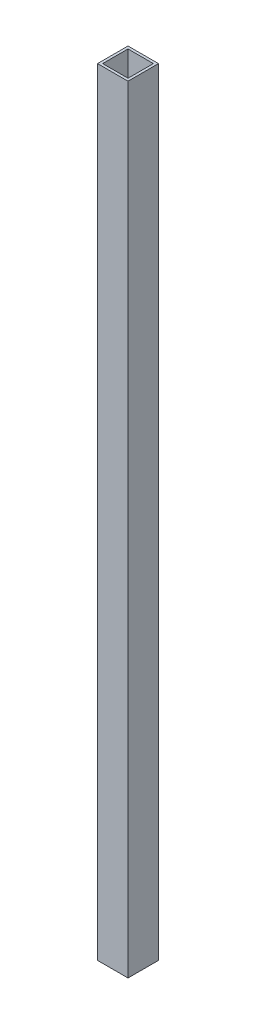
ISO-10303-21;
HEADER;
FILE_DESCRIPTION(('STEP AP214'),'2;1');
FILE_NAME('part.step','',(''),(''),'','','');
FILE_SCHEMA(('AUTOMOTIVE_DESIGN { 1 0 10303 214 1 1 1 1 }'));
ENDSEC;
DATA;
#1=APPLICATION_CONTEXT('core data for automotive mechanical design processes');
#2=APPLICATION_PROTOCOL_DEFINITION('international standard','automotive_design',2000,#1);
#3=PRODUCT_CONTEXT('',#1,'mechanical');
#4=PRODUCT('Part','Part','',(#3));
#5=PRODUCT_RELATED_PRODUCT_CATEGORY('part','',(#4));
#6=PRODUCT_DEFINITION_FORMATION('','',#4);
#7=PRODUCT_DEFINITION_CONTEXT('part definition',#1,'design');
#8=PRODUCT_DEFINITION('design','',#6,#7);
#9=PRODUCT_DEFINITION_SHAPE('','',#8);
#10=(LENGTH_UNIT() NAMED_UNIT(*) SI_UNIT(.MILLI.,.METRE.));
#11=(NAMED_UNIT(*) PLANE_ANGLE_UNIT() SI_UNIT($,.RADIAN.));
#12=(NAMED_UNIT(*) SI_UNIT($,.STERADIAN.) SOLID_ANGLE_UNIT());
#13=UNCERTAINTY_MEASURE_WITH_UNIT(LENGTH_MEASURE(1.E-05),#10,'distance_accuracy_value','');
#14=(GEOMETRIC_REPRESENTATION_CONTEXT(3) GLOBAL_UNCERTAINTY_ASSIGNED_CONTEXT((#13)) GLOBAL_UNIT_ASSIGNED_CONTEXT((#10,
#11,#12)) REPRESENTATION_CONTEXT('',''));
#15=CARTESIAN_POINT('',(0.,0.,0.));
#16=DIRECTION('',(0.,0.,1.));
#17=DIRECTION('',(1.,0.,0.));
#18=AXIS2_PLACEMENT_3D('',#15,#16,#17);
#19=CARTESIAN_POINT('',(0.,0.,-38.1));
#20=DIRECTION('',(-1.,0.,0.));
#21=DIRECTION('',(0.,-1.,0.));
#22=AXIS2_PLACEMENT_3D('',#19,#20,#21);
#23=PLANE('',#22);
#24=DIRECTION('',(0.,0.,-1.));
#25=VECTOR('',#24,1.);
#26=CARTESIAN_POINT('',(0.,1009.65,-38.1));
#27=LINE('',#26,#25);
#28=CARTESIAN_POINT('',(0.,1009.65,0.));
#29=VERTEX_POINT('',#28);
#30=CARTESIAN_POINT('',(0.,1009.65,-38.1));
#31=VERTEX_POINT('',#30);
#32=EDGE_CURVE('E111',#29,#31,#27,.T.);
#33=ORIENTED_EDGE('',*,*,#32,.F.);
#34=DIRECTION('',(0.,1.,0.));
#35=VECTOR('',#34,1.);
#36=CARTESIAN_POINT('',(0.,0.,0.));
#37=LINE('',#36,#35);
#38=CARTESIAN_POINT('',(0.,38.1,0.));
#39=VERTEX_POINT('',#38);
#40=EDGE_CURVE('E47',#39,#29,#37,.T.);
#41=ORIENTED_EDGE('',*,*,#40,.F.);
#42=DIRECTION('',(0.,0.,1.));
#43=VECTOR('',#42,1.);
#44=CARTESIAN_POINT('',(0.,38.1,-38.1));
#45=LINE('',#44,#43);
#46=CARTESIAN_POINT('',(0.,38.1,-38.1));
#47=VERTEX_POINT('',#46);
#48=EDGE_CURVE('E123',#47,#39,#45,.T.);
#49=ORIENTED_EDGE('',*,*,#48,.F.);
#50=DIRECTION('',(0.,1.,0.));
#51=VECTOR('',#50,1.);
#52=CARTESIAN_POINT('',(0.,0.,-38.1));
#53=LINE('',#52,#51);
#54=EDGE_CURVE('E130',#47,#31,#53,.T.);
#55=ORIENTED_EDGE('',*,*,#54,.T.);
#56=EDGE_LOOP('',(#33,#41,#49,#55));
#57=FACE_BOUND('',#56,.T.);
#58=ADVANCED_FACE('F33',(#57),#23,.F.);
#59=CARTESIAN_POINT('',(-38.1,0.,0.));
#60=DIRECTION('',(0.,0.,-1.));
#61=DIRECTION('',(-1.,0.,0.));
#62=AXIS2_PLACEMENT_3D('',#59,#60,#61);
#63=PLANE('',#62);
#64=DIRECTION('',(1.,0.,0.));
#65=VECTOR('',#64,1.);
#66=CARTESIAN_POINT('',(-38.0999999999998,1009.65,0.));
#67=LINE('',#66,#65);
#68=CARTESIAN_POINT('',(-38.1,1009.65,0.));
#69=VERTEX_POINT('',#68);
#70=EDGE_CURVE('E147',#69,#29,#67,.T.);
#71=ORIENTED_EDGE('',*,*,#70,.F.);
#72=DIRECTION('',(0.,1.,0.));
#73=VECTOR('',#72,1.);
#74=CARTESIAN_POINT('',(-38.1,0.,0.));
#75=LINE('',#74,#73);
#76=CARTESIAN_POINT('',(-38.1,38.1,0.));
#77=VERTEX_POINT('',#76);
#78=EDGE_CURVE('E120',#77,#69,#75,.T.);
#79=ORIENTED_EDGE('',*,*,#78,.F.);
#80=DIRECTION('',(1.,0.,0.));
#81=VECTOR('',#80,1.);
#82=CARTESIAN_POINT('',(-723.9,38.0999999999999,0.));
#83=LINE('',#82,#81);
#84=EDGE_CURVE('E158',#77,#39,#83,.T.);
#85=ORIENTED_EDGE('',*,*,#84,.T.);
#86=ORIENTED_EDGE('',*,*,#40,.T.);
#87=EDGE_LOOP('',(#71,#79,#85,#86));
#88=FACE_BOUND('',#87,.T.);
#89=ADVANCED_FACE('F173',(#88),#63,.F.);
#90=CARTESIAN_POINT('',(-38.1,0.,-38.1));
#91=DIRECTION('',(1.,0.,0.));
#92=DIRECTION('',(0.,1.,0.));
#93=AXIS2_PLACEMENT_3D('',#90,#91,#92);
#94=PLANE('',#93);
#95=DIRECTION('',(0.,0.,1.));
#96=VECTOR('',#95,1.);
#97=CARTESIAN_POINT('',(-38.1,1009.65,-38.1));
#98=LINE('',#97,#96);
#99=CARTESIAN_POINT('',(-38.1,1009.65,-38.1));
#100=VERTEX_POINT('',#99);
#101=EDGE_CURVE('E150',#100,#69,#98,.T.);
#102=ORIENTED_EDGE('',*,*,#101,.F.);
#103=DIRECTION('',(0.,1.,0.));
#104=VECTOR('',#103,1.);
#105=CARTESIAN_POINT('',(-38.1,0.,-38.1));
#106=LINE('',#105,#104);
#107=CARTESIAN_POINT('',(-38.1,38.1,-38.1));
#108=VERTEX_POINT('',#107);
#109=EDGE_CURVE('E132',#108,#100,#106,.T.);
#110=ORIENTED_EDGE('',*,*,#109,.F.);
#111=DIRECTION('',(0.,0.,-1.));
#112=VECTOR('',#111,1.);
#113=CARTESIAN_POINT('',(-38.1,38.1,-38.1));
#114=LINE('',#113,#112);
#115=EDGE_CURVE('E164',#77,#108,#114,.T.);
#116=ORIENTED_EDGE('',*,*,#115,.F.);
#117=ORIENTED_EDGE('',*,*,#78,.T.);
#118=EDGE_LOOP('',(#102,#110,#116,#117));
#119=FACE_BOUND('',#118,.T.);
#120=ADVANCED_FACE('F176',(#119),#94,.F.);
#121=CARTESIAN_POINT('',(-38.1,0.,-38.1));
#122=DIRECTION('',(0.,0.,1.));
#123=DIRECTION('',(1.,0.,0.));
#124=AXIS2_PLACEMENT_3D('',#121,#122,#123);
#125=PLANE('',#124);
#126=DIRECTION('',(-1.,0.,0.));
#127=VECTOR('',#126,1.);
#128=CARTESIAN_POINT('',(-38.0999999999998,1009.65,-38.1));
#129=LINE('',#128,#127);
#130=EDGE_CURVE('E153',#31,#100,#129,.T.);
#131=ORIENTED_EDGE('',*,*,#130,.F.);
#132=ORIENTED_EDGE('',*,*,#54,.F.);
#133=DIRECTION('',(1.,0.,0.));
#134=VECTOR('',#133,1.);
#135=CARTESIAN_POINT('',(-723.9,38.0999999999999,-38.1));
#136=LINE('',#135,#134);
#137=EDGE_CURVE('E156',#108,#47,#136,.T.);
#138=ORIENTED_EDGE('',*,*,#137,.F.);
#139=ORIENTED_EDGE('',*,*,#109,.T.);
#140=EDGE_LOOP('',(#131,#132,#138,#139));
#141=FACE_BOUND('',#140,.T.);
#142=ADVANCED_FACE('F179',(#141),#125,.F.);
#143=CARTESIAN_POINT('',(-723.9,38.0999999999999,-38.1));
#144=DIRECTION('',(0.,-1.,0.));
#145=DIRECTION('',(1.,0.,0.));
#146=AXIS2_PLACEMENT_3D('',#143,#144,#145);
#147=PLANE('',#146);
#148=DIRECTION('',(1.,0.,0.));
#149=VECTOR('',#148,1.);
#150=CARTESIAN_POINT('',(-34.925,38.1,-34.925));
#151=LINE('',#150,#149);
#152=CARTESIAN_POINT('',(-34.925,38.1,-34.925));
#153=VERTEX_POINT('',#152);
#154=CARTESIAN_POINT('',(-3.175,38.1,-34.925));
#155=VERTEX_POINT('',#154);
#156=EDGE_CURVE('E161',#153,#155,#151,.T.);
#157=ORIENTED_EDGE('',*,*,#156,.F.);
#158=DIRECTION('',(0.,0.,-1.));
#159=VECTOR('',#158,1.);
#160=CARTESIAN_POINT('',(-34.925,38.1,-34.925));
#161=LINE('',#160,#159);
#162=CARTESIAN_POINT('',(-34.925,38.1,-3.175));
#163=VERTEX_POINT('',#162);
#164=EDGE_CURVE('E140',#163,#153,#161,.T.);
#165=ORIENTED_EDGE('',*,*,#164,.F.);
#166=DIRECTION('',(-1.,0.,0.));
#167=VECTOR('',#166,1.);
#168=CARTESIAN_POINT('',(-34.925,38.1,-3.175));
#169=LINE('',#168,#167);
#170=CARTESIAN_POINT('',(-3.175,38.1,-3.175));
#171=VERTEX_POINT('',#170);
#172=EDGE_CURVE('E40',#171,#163,#169,.T.);
#173=ORIENTED_EDGE('',*,*,#172,.F.);
#174=DIRECTION('',(0.,0.,1.));
#175=VECTOR('',#174,1.);
#176=CARTESIAN_POINT('',(-3.175,38.1,-34.925));
#177=LINE('',#176,#175);
#178=EDGE_CURVE('E116',#155,#171,#177,.T.);
#179=ORIENTED_EDGE('',*,*,#178,.F.);
#180=EDGE_LOOP('',(#157,#165,#173,#179));
#181=FACE_BOUND('',#180,.T.);
#182=ORIENTED_EDGE('',*,*,#48,.T.);
#183=ORIENTED_EDGE('',*,*,#84,.F.);
#184=ORIENTED_EDGE('',*,*,#115,.T.);
#185=ORIENTED_EDGE('',*,*,#137,.T.);
#186=EDGE_LOOP('',(#182,#183,#184,#185));
#187=FACE_BOUND('',#186,.T.);
#188=ADVANCED_FACE('F169',(#181,#187),#147,.T.);
#189=CARTESIAN_POINT('',(-3.175,0.,-34.925));
#190=DIRECTION('',(-1.,0.,0.));
#191=DIRECTION('',(0.,-1.,0.));
#192=AXIS2_PLACEMENT_3D('',#189,#190,#191);
#193=PLANE('',#192);
#194=DIRECTION('',(0.,1.,0.));
#195=VECTOR('',#194,1.);
#196=CARTESIAN_POINT('',(-3.175,0.,-3.175));
#197=LINE('',#196,#195);
#198=CARTESIAN_POINT('',(-3.175,1009.65,-3.175));
#199=VERTEX_POINT('',#198);
#200=EDGE_CURVE('E107',#171,#199,#197,.T.);
#201=ORIENTED_EDGE('',*,*,#200,.T.);
#202=DIRECTION('',(0.,0.,-1.));
#203=VECTOR('',#202,1.);
#204=CARTESIAN_POINT('',(-3.175,1009.65,-34.925));
#205=LINE('',#204,#203);
#206=CARTESIAN_POINT('',(-3.175,1009.65,-34.925));
#207=VERTEX_POINT('',#206);
#208=EDGE_CURVE('E11',#199,#207,#205,.T.);
#209=ORIENTED_EDGE('',*,*,#208,.T.);
#210=DIRECTION('',(0.,1.,0.));
#211=VECTOR('',#210,1.);
#212=CARTESIAN_POINT('',(-3.175,0.,-34.925));
#213=LINE('',#212,#211);
#214=EDGE_CURVE('E128',#155,#207,#213,.T.);
#215=ORIENTED_EDGE('',*,*,#214,.F.);
#216=ORIENTED_EDGE('',*,*,#178,.T.);
#217=EDGE_LOOP('',(#201,#209,#215,#216));
#218=FACE_BOUND('',#217,.T.);
#219=ADVANCED_FACE('F115',(#218),#193,.T.);
#220=CARTESIAN_POINT('',(-34.925,0.,-34.925));
#221=DIRECTION('',(0.,0.,1.));
#222=DIRECTION('',(1.,0.,0.));
#223=AXIS2_PLACEMENT_3D('',#220,#221,#222);
#224=PLANE('',#223);
#225=ORIENTED_EDGE('',*,*,#214,.T.);
#226=DIRECTION('',(-1.,0.,0.));
#227=VECTOR('',#226,1.);
#228=CARTESIAN_POINT('',(-34.9249999999998,1009.65,-34.925));
#229=LINE('',#228,#227);
#230=CARTESIAN_POINT('',(-34.925,1009.65,-34.925));
#231=VERTEX_POINT('',#230);
#232=EDGE_CURVE('E55',#207,#231,#229,.T.);
#233=ORIENTED_EDGE('',*,*,#232,.T.);
#234=DIRECTION('',(0.,1.,0.));
#235=VECTOR('',#234,1.);
#236=CARTESIAN_POINT('',(-34.925,0.,-34.925));
#237=LINE('',#236,#235);
#238=EDGE_CURVE('E118',#153,#231,#237,.T.);
#239=ORIENTED_EDGE('',*,*,#238,.F.);
#240=ORIENTED_EDGE('',*,*,#156,.T.);
#241=EDGE_LOOP('',(#225,#233,#239,#240));
#242=FACE_BOUND('',#241,.T.);
#243=ADVANCED_FACE('F221',(#242),#224,.T.);
#244=CARTESIAN_POINT('',(-34.925,0.,-34.925));
#245=DIRECTION('',(1.,0.,0.));
#246=DIRECTION('',(0.,1.,0.));
#247=AXIS2_PLACEMENT_3D('',#244,#245,#246);
#248=PLANE('',#247);
#249=ORIENTED_EDGE('',*,*,#238,.T.);
#250=DIRECTION('',(0.,0.,1.));
#251=VECTOR('',#250,1.);
#252=CARTESIAN_POINT('',(-34.925,1009.65,-34.925));
#253=LINE('',#252,#251);
#254=CARTESIAN_POINT('',(-34.925,1009.65,-3.175));
#255=VERTEX_POINT('',#254);
#256=EDGE_CURVE('E112',#231,#255,#253,.T.);
#257=ORIENTED_EDGE('',*,*,#256,.T.);
#258=DIRECTION('',(0.,1.,0.));
#259=VECTOR('',#258,1.);
#260=CARTESIAN_POINT('',(-34.925,0.,-3.175));
#261=LINE('',#260,#259);
#262=EDGE_CURVE('E109',#163,#255,#261,.T.);
#263=ORIENTED_EDGE('',*,*,#262,.F.);
#264=ORIENTED_EDGE('',*,*,#164,.T.);
#265=EDGE_LOOP('',(#249,#257,#263,#264));
#266=FACE_BOUND('',#265,.T.);
#267=ADVANCED_FACE('F139',(#266),#248,.T.);
#268=CARTESIAN_POINT('',(-34.925,0.,-3.175));
#269=DIRECTION('',(0.,0.,-1.));
#270=DIRECTION('',(-1.,0.,0.));
#271=AXIS2_PLACEMENT_3D('',#268,#269,#270);
#272=PLANE('',#271);
#273=ORIENTED_EDGE('',*,*,#262,.T.);
#274=DIRECTION('',(1.,0.,0.));
#275=VECTOR('',#274,1.);
#276=CARTESIAN_POINT('',(-34.9249999999998,1009.65,-3.175));
#277=LINE('',#276,#275);
#278=EDGE_CURVE('E98',#255,#199,#277,.T.);
#279=ORIENTED_EDGE('',*,*,#278,.T.);
#280=ORIENTED_EDGE('',*,*,#200,.F.);
#281=ORIENTED_EDGE('',*,*,#172,.T.);
#282=EDGE_LOOP('',(#273,#279,#280,#281));
#283=FACE_BOUND('',#282,.T.);
#284=ADVANCED_FACE('F105',(#283),#272,.T.);
#285=CARTESIAN_POINT('',(0.,1009.65,0.));
#286=DIRECTION('',(0.,1.,0.));
#287=DIRECTION('',(-1.,0.,0.));
#288=AXIS2_PLACEMENT_3D('',#285,#286,#287);
#289=PLANE('',#288);
#290=ORIENTED_EDGE('',*,*,#278,.F.);
#291=ORIENTED_EDGE('',*,*,#256,.F.);
#292=ORIENTED_EDGE('',*,*,#232,.F.);
#293=ORIENTED_EDGE('',*,*,#208,.F.);
#294=EDGE_LOOP('',(#290,#291,#292,#293));
#295=FACE_BOUND('',#294,.T.);
#296=ORIENTED_EDGE('',*,*,#32,.T.);
#297=ORIENTED_EDGE('',*,*,#130,.T.);
#298=ORIENTED_EDGE('',*,*,#101,.T.);
#299=ORIENTED_EDGE('',*,*,#70,.T.);
#300=EDGE_LOOP('',(#296,#297,#298,#299));
#301=FACE_BOUND('',#300,.T.);
#302=ADVANCED_FACE('F96',(#295,#301),#289,.T.);
#303=CLOSED_SHELL('',(#58,#89,#120,#142,#188,#219,#243,#267,#284,#302));
#304=MANIFOLD_SOLID_BREP('B2',#303);
#305=ADVANCED_BREP_SHAPE_REPRESENTATION('',(#18,#304),#14);
#306=SHAPE_DEFINITION_REPRESENTATION(#9,#305);
ENDSEC;
END-ISO-10303-21;
